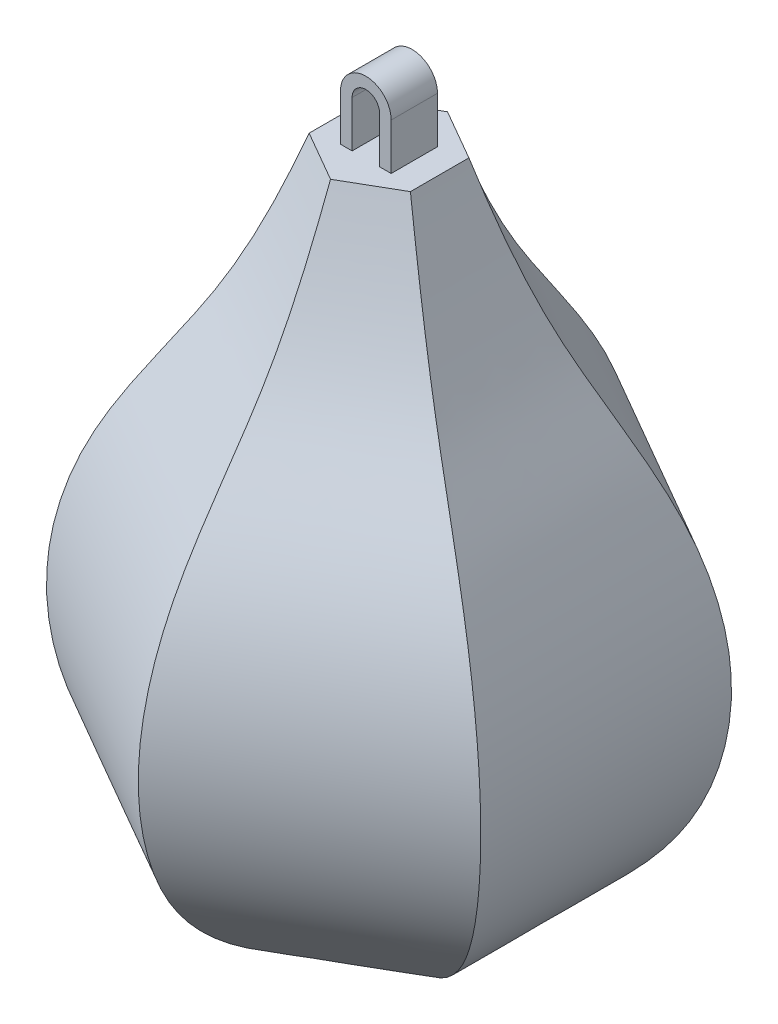
ISO-10303-21;
HEADER;
FILE_DESCRIPTION(('STEP AP214'),'2;1');
FILE_NAME('part.step','',(''),(''),'','','');
FILE_SCHEMA(('AUTOMOTIVE_DESIGN { 1 0 10303 214 1 1 1 1 }'));
ENDSEC;
DATA;
#1=APPLICATION_CONTEXT('core data for automotive mechanical design processes');
#2=APPLICATION_PROTOCOL_DEFINITION('international standard','automotive_design',2000,#1);
#3=PRODUCT_CONTEXT('',#1,'mechanical');
#4=PRODUCT('Part','Part','',(#3));
#5=PRODUCT_RELATED_PRODUCT_CATEGORY('part','',(#4));
#6=PRODUCT_DEFINITION_FORMATION('','',#4);
#7=PRODUCT_DEFINITION_CONTEXT('part definition',#1,'design');
#8=PRODUCT_DEFINITION('design','',#6,#7);
#9=PRODUCT_DEFINITION_SHAPE('','',#8);
#10=(LENGTH_UNIT() NAMED_UNIT(*) SI_UNIT(.MILLI.,.METRE.));
#11=(NAMED_UNIT(*) PLANE_ANGLE_UNIT() SI_UNIT($,.RADIAN.));
#12=(NAMED_UNIT(*) SI_UNIT($,.STERADIAN.) SOLID_ANGLE_UNIT());
#13=UNCERTAINTY_MEASURE_WITH_UNIT(LENGTH_MEASURE(1.E-05),#10,'distance_accuracy_value','');
#14=(GEOMETRIC_REPRESENTATION_CONTEXT(3) GLOBAL_UNCERTAINTY_ASSIGNED_CONTEXT((#13)) GLOBAL_UNIT_ASSIGNED_CONTEXT((#10,
#11,#12)) REPRESENTATION_CONTEXT('',''));
#15=CARTESIAN_POINT('',(0.,0.,0.));
#16=DIRECTION('',(0.,0.,1.));
#17=DIRECTION('',(1.,0.,0.));
#18=AXIS2_PLACEMENT_3D('',#15,#16,#17);
#19=CARTESIAN_POINT('',(0.,230.,0.));
#20=DIRECTION('',(0.,1.,0.));
#21=DIRECTION('',(0.,0.,1.));
#22=AXIS2_PLACEMENT_3D('',#19,#20,#21);
#23=PLANE('',#22);
#24=DIRECTION('',(0.,0.,-1.));
#25=VECTOR('',#24,1.);
#26=CARTESIAN_POINT('',(-4.75,230.,8.));
#27=LINE('',#26,#25);
#28=CARTESIAN_POINT('',(-4.75,230.,8.));
#29=VERTEX_POINT('',#28);
#30=CARTESIAN_POINT('',(-4.75,230.,-8.));
#31=VERTEX_POINT('',#30);
#32=EDGE_CURVE('E208',#29,#31,#27,.T.);
#33=ORIENTED_EDGE('',*,*,#32,.F.);
#34=DIRECTION('',(1.,0.,0.));
#35=VECTOR('',#34,1.);
#36=CARTESIAN_POINT('',(-8.75,230.,8.));
#37=LINE('',#36,#35);
#38=CARTESIAN_POINT('',(-8.75,230.,8.));
#39=VERTEX_POINT('',#38);
#40=EDGE_CURVE('E171',#39,#29,#37,.T.);
#41=ORIENTED_EDGE('',*,*,#40,.F.);
#42=DIRECTION('',(0.,0.,-1.));
#43=VECTOR('',#42,1.);
#44=CARTESIAN_POINT('',(-8.75,230.,8.));
#45=LINE('',#44,#43);
#46=CARTESIAN_POINT('',(-8.75,230.,-8.));
#47=VERTEX_POINT('',#46);
#48=EDGE_CURVE('E211',#39,#47,#45,.T.);
#49=ORIENTED_EDGE('',*,*,#48,.T.);
#50=DIRECTION('',(1.,0.,0.));
#51=VECTOR('',#50,1.);
#52=CARTESIAN_POINT('',(-8.75,230.,-8.));
#53=LINE('',#52,#51);
#54=EDGE_CURVE('E192',#47,#31,#53,.T.);
#55=ORIENTED_EDGE('',*,*,#54,.T.);
#56=EDGE_LOOP('',(#33,#41,#49,#55));
#57=FACE_BOUND('',#56,.T.);
#58=DIRECTION('',(0.866025403784439,0.,0.5));
#59=VECTOR('',#58,1.);
#60=CARTESIAN_POINT('',(-17.5,230.,10.1036297108184));
#61=LINE('',#60,#59);
#62=CARTESIAN_POINT('',(-17.5,230.,10.1036297108184));
#63=VERTEX_POINT('',#62);
#64=CARTESIAN_POINT('',(0.,230.,20.2072594216369));
#65=VERTEX_POINT('',#64);
#66=EDGE_CURVE('E215',#63,#65,#61,.T.);
#67=ORIENTED_EDGE('',*,*,#66,.T.);
#68=DIRECTION('',(0.866025403784439,0.,-0.5));
#69=VECTOR('',#68,1.);
#70=CARTESIAN_POINT('',(0.,230.,20.2072594216369));
#71=LINE('',#70,#69);
#72=CARTESIAN_POINT('',(17.5,230.,10.1036297108184));
#73=VERTEX_POINT('',#72);
#74=EDGE_CURVE('E283',#65,#73,#71,.T.);
#75=ORIENTED_EDGE('',*,*,#74,.T.);
#76=DIRECTION('',(0.,0.,-1.));
#77=VECTOR('',#76,1.);
#78=CARTESIAN_POINT('',(17.5,230.,10.1036297108184));
#79=LINE('',#78,#77);
#80=CARTESIAN_POINT('',(17.5,230.,-10.1036297108185));
#81=VERTEX_POINT('',#80);
#82=EDGE_CURVE('E492',#73,#81,#79,.T.);
#83=ORIENTED_EDGE('',*,*,#82,.T.);
#84=DIRECTION('',(-0.866025403784439,0.,-0.5));
#85=VECTOR('',#84,1.);
#86=CARTESIAN_POINT('',(17.5,230.,-10.1036297108185));
#87=LINE('',#86,#85);
#88=CARTESIAN_POINT('',(0.,230.,-20.2072594216369));
#89=VERTEX_POINT('',#88);
#90=EDGE_CURVE('E486',#81,#89,#87,.T.);
#91=ORIENTED_EDGE('',*,*,#90,.T.);
#92=DIRECTION('',(-0.866025403784439,0.,0.5));
#93=VECTOR('',#92,1.);
#94=CARTESIAN_POINT('',(0.,230.,-20.2072594216369));
#95=LINE('',#94,#93);
#96=CARTESIAN_POINT('',(-17.5,230.,-10.1036297108185));
#97=VERTEX_POINT('',#96);
#98=EDGE_CURVE('E400',#89,#97,#95,.T.);
#99=ORIENTED_EDGE('',*,*,#98,.T.);
#100=DIRECTION('',(0.,0.,1.));
#101=VECTOR('',#100,1.);
#102=CARTESIAN_POINT('',(-17.5,230.,-10.1036297108185));
#103=LINE('',#102,#101);
#104=EDGE_CURVE('E469',#97,#63,#103,.T.);
#105=ORIENTED_EDGE('',*,*,#104,.T.);
#106=EDGE_LOOP('',(#67,#75,#83,#91,#99,#105));
#107=FACE_BOUND('',#106,.T.);
#108=DIRECTION('',(0.,0.,-1.));
#109=VECTOR('',#108,1.);
#110=CARTESIAN_POINT('',(8.75000000000001,230.,8.));
#111=LINE('',#110,#109);
#112=CARTESIAN_POINT('',(8.75000000000001,230.,8.));
#113=VERTEX_POINT('',#112);
#114=CARTESIAN_POINT('',(8.75000000000001,230.,-8.));
#115=VERTEX_POINT('',#114);
#116=EDGE_CURVE('E65',#113,#115,#111,.T.);
#117=ORIENTED_EDGE('',*,*,#116,.F.);
#118=DIRECTION('',(1.,0.,0.));
#119=VECTOR('',#118,1.);
#120=CARTESIAN_POINT('',(4.75000000000001,230.,8.));
#121=LINE('',#120,#119);
#122=CARTESIAN_POINT('',(4.75000000000001,230.,8.));
#123=VERTEX_POINT('',#122);
#124=EDGE_CURVE('E69',#123,#113,#121,.T.);
#125=ORIENTED_EDGE('',*,*,#124,.F.);
#126=DIRECTION('',(0.,0.,-1.));
#127=VECTOR('',#126,1.);
#128=CARTESIAN_POINT('',(4.75000000000001,230.,8.));
#129=LINE('',#128,#127);
#130=CARTESIAN_POINT('',(4.75000000000001,230.,-8.));
#131=VERTEX_POINT('',#130);
#132=EDGE_CURVE('E183',#123,#131,#129,.T.);
#133=ORIENTED_EDGE('',*,*,#132,.T.);
#134=DIRECTION('',(1.,0.,0.));
#135=VECTOR('',#134,1.);
#136=CARTESIAN_POINT('',(4.75000000000001,230.,-8.));
#137=LINE('',#136,#135);
#138=EDGE_CURVE('E184',#131,#115,#137,.T.);
#139=ORIENTED_EDGE('',*,*,#138,.T.);
#140=EDGE_LOOP('',(#117,#125,#133,#139));
#141=FACE_BOUND('',#140,.T.);
#142=ADVANCED_FACE('F47',(#57,#107,#141),#23,.T.);
#143=CARTESIAN_POINT('',(0.,0.,0.));
#144=DIRECTION('',(0.,1.,0.));
#145=DIRECTION('',(0.,0.,1.));
#146=AXIS2_PLACEMENT_3D('',#143,#144,#145);
#147=PLANE('',#146);
#148=DIRECTION('',(0.866025403784439,0.,0.5));
#149=VECTOR('',#148,1.);
#150=CARTESIAN_POINT('',(-20.,0.,11.5470053837925));
#151=LINE('',#150,#149);
#152=CARTESIAN_POINT('',(-20.,0.,11.5470053837925));
#153=VERTEX_POINT('',#152);
#154=CARTESIAN_POINT('',(0.,0.,23.094010767585));
#155=VERTEX_POINT('',#154);
#156=EDGE_CURVE('E411',#153,#155,#151,.T.);
#157=ORIENTED_EDGE('',*,*,#156,.F.);
#158=DIRECTION('',(0.,0.,1.));
#159=VECTOR('',#158,1.);
#160=CARTESIAN_POINT('',(-20.,0.,-11.5470053837925));
#161=LINE('',#160,#159);
#162=CARTESIAN_POINT('',(-20.,0.,-11.5470053837925));
#163=VERTEX_POINT('',#162);
#164=EDGE_CURVE('E12',#163,#153,#161,.T.);
#165=ORIENTED_EDGE('',*,*,#164,.F.);
#166=DIRECTION('',(-0.866025403784439,0.,0.5));
#167=VECTOR('',#166,1.);
#168=CARTESIAN_POINT('',(0.,0.,-23.094010767585));
#169=LINE('',#168,#167);
#170=CARTESIAN_POINT('',(0.,0.,-23.094010767585));
#171=VERTEX_POINT('',#170);
#172=EDGE_CURVE('E57',#171,#163,#169,.T.);
#173=ORIENTED_EDGE('',*,*,#172,.F.);
#174=DIRECTION('',(-0.866025403784439,0.,-0.5));
#175=VECTOR('',#174,1.);
#176=CARTESIAN_POINT('',(20.,0.,-11.5470053837925));
#177=LINE('',#176,#175);
#178=CARTESIAN_POINT('',(20.,0.,-11.5470053837925));
#179=VERTEX_POINT('',#178);
#180=EDGE_CURVE('E365',#179,#171,#177,.T.);
#181=ORIENTED_EDGE('',*,*,#180,.F.);
#182=DIRECTION('',(0.,0.,-1.));
#183=VECTOR('',#182,1.);
#184=CARTESIAN_POINT('',(20.,0.,11.5470053837925));
#185=LINE('',#184,#183);
#186=CARTESIAN_POINT('',(20.,0.,11.5470053837925));
#187=VERTEX_POINT('',#186);
#188=EDGE_CURVE('E342',#187,#179,#185,.T.);
#189=ORIENTED_EDGE('',*,*,#188,.F.);
#190=DIRECTION('',(0.866025403784439,0.,-0.5));
#191=VECTOR('',#190,1.);
#192=CARTESIAN_POINT('',(0.,0.,23.094010767585));
#193=LINE('',#192,#191);
#194=EDGE_CURVE('E449',#155,#187,#193,.T.);
#195=ORIENTED_EDGE('',*,*,#194,.F.);
#196=EDGE_LOOP('',(#157,#165,#173,#181,#189,#195));
#197=FACE_BOUND('',#196,.T.);
#198=ADVANCED_FACE('F240',(#197),#147,.F.);
#199=CARTESIAN_POINT('',(-20.,0.,-11.5470053837925));
#200=CARTESIAN_POINT('',(-38.5782747603834,10.0532481363152,-22.2731773177787));
#201=CARTESIAN_POINT('',(-66.4179175298763,30.175840695107,-38.3464025648885));
#202=CARTESIAN_POINT('',(-78.6104133130519,83.4781598482992,-45.3857432873982));
#203=CARTESIAN_POINT('',(-67.2767704858389,133.971135215515,-38.8422615502078));
#204=CARTESIAN_POINT('',(-35.7912072285013,177.691718086682,-20.6640631279969));
#205=CARTESIAN_POINT('',(-23.2057441810805,212.724749092462,-13.3978426496924));
#206=CARTESIAN_POINT('',(-17.5,230.,-10.1036297108185));
#207=CARTESIAN_POINT('',(-20.,0.,-3.8490017945975));
#208=CARTESIAN_POINT('',(-38.5782747603834,10.0532481363152,-7.42439243925957));
#209=CARTESIAN_POINT('',(-66.4179175298763,30.175840695107,-12.7821341882962));
#210=CARTESIAN_POINT('',(-78.6104133130519,83.4781598482992,-15.1285810957994));
#211=CARTESIAN_POINT('',(-67.2767704858389,133.971135215515,-12.9474205167359));
#212=CARTESIAN_POINT('',(-35.7912072285013,177.691718086682,-6.88802104266564));
#213=CARTESIAN_POINT('',(-23.2057441810805,212.724749092462,-4.46594754989747));
#214=CARTESIAN_POINT('',(-17.5,230.,-3.36787657027282));
#215=CARTESIAN_POINT('',(-20.,0.,3.84900179459751));
#216=CARTESIAN_POINT('',(-38.5782747603834,10.0532481363152,7.42439243925956));
#217=CARTESIAN_POINT('',(-66.4179175298763,30.175840695107,12.7821341882961));
#218=CARTESIAN_POINT('',(-78.6104133130519,83.4781598482992,15.1285810957994));
#219=CARTESIAN_POINT('',(-67.2767704858389,133.971135215515,12.9474205167359));
#220=CARTESIAN_POINT('',(-35.7912072285013,177.691718086682,6.88802104266564));
#221=CARTESIAN_POINT('',(-23.2057441810805,212.724749092462,4.46594754989747));
#222=CARTESIAN_POINT('',(-17.5,230.,3.36787657027281));
#223=CARTESIAN_POINT('',(-20.,0.,11.5470053837925));
#224=CARTESIAN_POINT('',(-38.5782747603834,10.0532481363152,22.2731773177787));
#225=CARTESIAN_POINT('',(-66.4179175298763,30.175840695107,38.3464025648885));
#226=CARTESIAN_POINT('',(-78.6104133130519,83.4781598482992,45.3857432873982));
#227=CARTESIAN_POINT('',(-67.2767704858389,133.971135215515,38.8422615502077));
#228=CARTESIAN_POINT('',(-35.7912072285013,177.691718086682,20.6640631279969));
#229=CARTESIAN_POINT('',(-23.2057441810805,212.724749092462,13.3978426496924));
#230=CARTESIAN_POINT('',(-17.5,230.,10.1036297108184));
#231=B_SPLINE_SURFACE_WITH_KNOTS('',3,3,((#199,#200,#201,#202,#203,#204,#205,#206),(#207,#208,
#209,#210,#211,#212,#213,#214),(#215,#216,#217,#218,#219,#220,#221,#222),(#223,#224,#225,#226,
#227,#228,#229,#230)),.UNSPECIFIED.,.F.,.F.,.F.,(4,4),(4,1,1,1,1,4),(0.,1.),(0.,
0.234591966834388,0.389139212504296,0.579946693526155,0.796843671175481,1.),.UNSPECIFIED.);
#232=CARTESIAN_POINT('',(-20.,0.,11.5470053837925));
#233=CARTESIAN_POINT('',(-38.5782747603834,10.0532481363152,22.2731773177787));
#234=CARTESIAN_POINT('',(-66.4179175298763,30.175840695107,38.3464025648885));
#235=CARTESIAN_POINT('',(-78.6104133130519,83.4781598482992,45.3857432873982));
#236=CARTESIAN_POINT('',(-67.2767704858389,133.971135215515,38.8422615502077));
#237=CARTESIAN_POINT('',(-35.7912072285013,177.691718086682,20.6640631279969));
#238=CARTESIAN_POINT('',(-23.2057441810805,212.724749092462,13.3978426496924));
#239=CARTESIAN_POINT('',(-17.5,230.,10.1036297108184));
#240=B_SPLINE_CURVE_WITH_KNOTS('',3,(#232,#233,#234,#235,#236,#237,#238,#239),.UNSPECIFIED.,.F.,
.F.,(4,1,1,1,1,4),(0.,0.234591966834388,0.389139212504296,0.579946693526155,0.796843671175481,
1.),.UNSPECIFIED.);
#241=EDGE_CURVE('E517',#153,#63,#240,.T.);
#242=CARTESIAN_POINT('',(-20.,0.,-11.5470053837925));
#243=CARTESIAN_POINT('',(-38.5782747603834,10.0532481363152,-22.2731773177787));
#244=CARTESIAN_POINT('',(-66.4179175298763,30.175840695107,-38.3464025648885));
#245=CARTESIAN_POINT('',(-78.6104133130519,83.4781598482992,-45.3857432873982));
#246=CARTESIAN_POINT('',(-67.2767704858389,133.971135215515,-38.8422615502078));
#247=CARTESIAN_POINT('',(-35.7912072285013,177.691718086682,-20.6640631279969));
#248=CARTESIAN_POINT('',(-23.2057441810805,212.724749092462,-13.3978426496924));
#249=CARTESIAN_POINT('',(-17.5,230.,-10.1036297108185));
#250=B_SPLINE_CURVE_WITH_KNOTS('',3,(#242,#243,#244,#245,#246,#247,#248,#249),.UNSPECIFIED.,.F.,
.F.,(4,1,1,1,1,4),(0.,0.234591966834388,0.389139212504296,0.579946693526155,0.796843671175481,
1.),.UNSPECIFIED.);
#251=EDGE_CURVE('E225',#97,#163,#250,.F.);
#252=ORIENTED_EDGE('',*,*,#164,.T.);
#253=ORIENTED_EDGE('',*,*,#241,.T.);
#254=ORIENTED_EDGE('',*,*,#104,.F.);
#255=ORIENTED_EDGE('',*,*,#251,.T.);
#256=EDGE_LOOP('',(#252,#253,#254,#255));
#257=FACE_BOUND('',#256,.T.);
#258=ADVANCED_FACE('F227',(#257),#231,.T.);
#259=CARTESIAN_POINT('',(-20.,0.,11.5470053837925));
#260=CARTESIAN_POINT('',(-38.5782747603834,10.0532481363152,22.2731773177787));
#261=CARTESIAN_POINT('',(-66.4179175298763,30.175840695107,38.3464025648885));
#262=CARTESIAN_POINT('',(-78.6104133130519,83.4781598482992,45.3857432873982));
#263=CARTESIAN_POINT('',(-67.2767704858389,133.971135215515,38.8422615502077));
#264=CARTESIAN_POINT('',(-35.7912072285013,177.691718086682,20.6640631279969));
#265=CARTESIAN_POINT('',(-23.2057441810805,212.724749092462,13.3978426496924));
#266=CARTESIAN_POINT('',(-17.5,230.,10.1036297108184));
#267=CARTESIAN_POINT('',(-13.3333333333333,0.,15.39600717839));
#268=CARTESIAN_POINT('',(-25.7188498402556,10.0532481363152,29.6975697570383));
#269=CARTESIAN_POINT('',(-44.2786116865843,30.175840695107,51.1285367531846));
#270=CARTESIAN_POINT('',(-52.4069422087012,83.4781598482992,60.5143243831977));
#271=CARTESIAN_POINT('',(-44.8511803238926,133.971135215515,51.7896820669436));
#272=CARTESIAN_POINT('',(-23.8608048190009,177.691718086682,27.5520841706626));
#273=CARTESIAN_POINT('',(-15.4704961207203,212.724749092462,17.8637901995899));
#274=CARTESIAN_POINT('',(-11.6666666666667,230.,13.4715062810913));
#275=CARTESIAN_POINT('',(-6.66666666666666,0.,19.2450089729875));
#276=CARTESIAN_POINT('',(-12.8594249201278,10.0532481363152,37.1219621962978));
#277=CARTESIAN_POINT('',(-22.1393058432922,30.175840695107,63.9106709414808));
#278=CARTESIAN_POINT('',(-26.2034711043506,83.4781598482992,75.6429054789971));
#279=CARTESIAN_POINT('',(-22.4255901619463,133.971135215515,64.7371025836796));
#280=CARTESIAN_POINT('',(-11.9304024095004,177.691718086682,34.4401052133282));
#281=CARTESIAN_POINT('',(-7.73524806036016,212.724749092462,22.3297377494874));
#282=CARTESIAN_POINT('',(-5.83333333333333,230.,16.8393828513641));
#283=CARTESIAN_POINT('',(0.,0.,23.094010767585));
#284=CARTESIAN_POINT('',(0.,10.0532481363152,44.5463546355574));
#285=CARTESIAN_POINT('',(0.,30.175840695107,76.6928051297769));
#286=CARTESIAN_POINT('',(0.,83.4781598482992,90.7714865747965));
#287=CARTESIAN_POINT('',(0.,133.971135215515,77.6845231004155));
#288=CARTESIAN_POINT('',(0.,177.691718086682,41.3281262559938));
#289=CARTESIAN_POINT('',(0.,212.724749092462,26.7956852993848));
#290=CARTESIAN_POINT('',(0.,230.,20.2072594216369));
#291=B_SPLINE_SURFACE_WITH_KNOTS('',3,3,((#259,#260,#261,#262,#263,#264,#265,#266),(#267,#268,
#269,#270,#271,#272,#273,#274),(#275,#276,#277,#278,#279,#280,#281,#282),(#283,#284,#285,#286,
#287,#288,#289,#290)),.UNSPECIFIED.,.F.,.F.,.F.,(4,4),(4,1,1,1,1,4),(0.,1.),(0.,
0.234591966834388,0.389139212504296,0.579946693526155,0.796843671175481,1.),.UNSPECIFIED.);
#292=CARTESIAN_POINT('',(0.,0.,23.094010767585));
#293=CARTESIAN_POINT('',(0.,10.0532481363152,44.5463546355574));
#294=CARTESIAN_POINT('',(0.,30.175840695107,76.6928051297769));
#295=CARTESIAN_POINT('',(0.,83.4781598482992,90.7714865747965));
#296=CARTESIAN_POINT('',(0.,133.971135215515,77.6845231004155));
#297=CARTESIAN_POINT('',(0.,177.691718086682,41.3281262559938));
#298=CARTESIAN_POINT('',(0.,212.724749092462,26.7956852993848));
#299=CARTESIAN_POINT('',(0.,230.,20.2072594216369));
#300=B_SPLINE_CURVE_WITH_KNOTS('',3,(#292,#293,#294,#295,#296,#297,#298,#299),.UNSPECIFIED.,.F.,
.F.,(4,1,1,1,1,4),(0.,0.234591966834388,0.389139212504296,0.579946693526155,0.796843671175481,
1.),.UNSPECIFIED.);
#301=EDGE_CURVE('E328',#155,#65,#300,.T.);
#302=ORIENTED_EDGE('',*,*,#156,.T.);
#303=ORIENTED_EDGE('',*,*,#301,.T.);
#304=ORIENTED_EDGE('',*,*,#66,.F.);
#305=ORIENTED_EDGE('',*,*,#241,.F.);
#306=EDGE_LOOP('',(#302,#303,#304,#305));
#307=FACE_BOUND('',#306,.T.);
#308=ADVANCED_FACE('F239',(#307),#291,.T.);
#309=CARTESIAN_POINT('',(0.,0.,-23.094010767585));
#310=CARTESIAN_POINT('',(0.,10.0532481363152,-44.5463546355574));
#311=CARTESIAN_POINT('',(0.,30.175840695107,-76.6928051297769));
#312=CARTESIAN_POINT('',(0.,83.4781598482992,-90.7714865747965));
#313=CARTESIAN_POINT('',(0.,133.971135215515,-77.6845231004155));
#314=CARTESIAN_POINT('',(0.,177.691718086682,-41.3281262559938));
#315=CARTESIAN_POINT('',(0.,212.724749092462,-26.7956852993848));
#316=CARTESIAN_POINT('',(0.,230.,-20.2072594216369));
#317=CARTESIAN_POINT('',(-6.66666666666667,0.,-19.2450089729875));
#318=CARTESIAN_POINT('',(-12.8594249201278,10.0532481363152,-37.1219621962978));
#319=CARTESIAN_POINT('',(-22.139305843292,30.175840695107,-63.9106709414808));
#320=CARTESIAN_POINT('',(-26.2034711043507,83.4781598482992,-75.6429054789971));
#321=CARTESIAN_POINT('',(-22.4255901619463,133.971135215515,-64.7371025836796));
#322=CARTESIAN_POINT('',(-11.9304024095004,177.691718086682,-34.4401052133282));
#323=CARTESIAN_POINT('',(-7.73524806036017,212.724749092462,-22.3297377494874));
#324=CARTESIAN_POINT('',(-5.83333333333334,230.,-16.8393828513641));
#325=CARTESIAN_POINT('',(-13.3333333333333,0.,-15.39600717839));
#326=CARTESIAN_POINT('',(-25.7188498402556,10.0532481363152,-29.6975697570383));
#327=CARTESIAN_POINT('',(-44.2786116865842,30.175840695107,-51.1285367531846));
#328=CARTESIAN_POINT('',(-52.4069422087013,83.4781598482992,-60.5143243831977));
#329=CARTESIAN_POINT('',(-44.8511803238926,133.971135215515,-51.7896820669437));
#330=CARTESIAN_POINT('',(-23.8608048190009,177.691718086682,-27.5520841706625));
#331=CARTESIAN_POINT('',(-15.4704961207203,212.724749092462,-17.8637901995899));
#332=CARTESIAN_POINT('',(-11.6666666666667,230.,-13.4715062810913));
#333=CARTESIAN_POINT('',(-20.,0.,-11.5470053837925));
#334=CARTESIAN_POINT('',(-38.5782747603834,10.0532481363152,-22.2731773177787));
#335=CARTESIAN_POINT('',(-66.4179175298763,30.175840695107,-38.3464025648885));
#336=CARTESIAN_POINT('',(-78.6104133130519,83.4781598482992,-45.3857432873983));
#337=CARTESIAN_POINT('',(-67.2767704858389,133.971135215515,-38.8422615502078));
#338=CARTESIAN_POINT('',(-35.7912072285013,177.691718086682,-20.6640631279969));
#339=CARTESIAN_POINT('',(-23.2057441810805,212.724749092462,-13.3978426496924));
#340=CARTESIAN_POINT('',(-17.5,230.,-10.1036297108184));
#341=B_SPLINE_SURFACE_WITH_KNOTS('',3,3,((#309,#310,#311,#312,#313,#314,#315,#316),(#317,#318,
#319,#320,#321,#322,#323,#324),(#325,#326,#327,#328,#329,#330,#331,#332),(#333,#334,#335,#336,
#337,#338,#339,#340)),.UNSPECIFIED.,.F.,.F.,.F.,(4,4),(4,1,1,1,1,4),(0.,1.),(0.,
0.234591966834388,0.389139212504296,0.579946693526155,0.796843671175481,1.),.UNSPECIFIED.);
#342=CARTESIAN_POINT('',(0.,0.,-23.094010767585));
#343=CARTESIAN_POINT('',(0.,10.0532481363152,-44.5463546355574));
#344=CARTESIAN_POINT('',(0.,30.175840695107,-76.6928051297769));
#345=CARTESIAN_POINT('',(-1.0720669007416E-13,83.4781598482992,-90.7714865747965));
#346=CARTESIAN_POINT('',(0.,133.971135215515,-77.6845231004155));
#347=CARTESIAN_POINT('',(0.,177.691718086682,-41.3281262559938));
#348=CARTESIAN_POINT('',(0.,212.724749092462,-26.7956852993848));
#349=CARTESIAN_POINT('',(0.,230.,-20.2072594216369));
#350=B_SPLINE_CURVE_WITH_KNOTS('',3,(#342,#343,#344,#345,#346,#347,#348,#349),.UNSPECIFIED.,.F.,
.F.,(4,1,1,1,1,4),(0.,0.234591966834388,0.389139212504296,0.579946693526155,0.796843671175481,
1.),.UNSPECIFIED.);
#351=EDGE_CURVE('E353',#171,#89,#350,.T.);
#352=ORIENTED_EDGE('',*,*,#172,.T.);
#353=ORIENTED_EDGE('',*,*,#251,.F.);
#354=ORIENTED_EDGE('',*,*,#98,.F.);
#355=ORIENTED_EDGE('',*,*,#351,.F.);
#356=EDGE_LOOP('',(#352,#353,#354,#355));
#357=FACE_BOUND('',#356,.T.);
#358=ADVANCED_FACE('F301',(#357),#341,.T.);
#359=CARTESIAN_POINT('',(0.,0.,23.094010767585));
#360=CARTESIAN_POINT('',(0.,10.0532481363152,44.5463546355574));
#361=CARTESIAN_POINT('',(0.,30.175840695107,76.6928051297769));
#362=CARTESIAN_POINT('',(0.,83.4781598482992,90.7714865747965));
#363=CARTESIAN_POINT('',(0.,133.971135215515,77.6845231004155));
#364=CARTESIAN_POINT('',(0.,177.691718086682,41.3281262559938));
#365=CARTESIAN_POINT('',(0.,212.724749092462,26.7956852993848));
#366=CARTESIAN_POINT('',(0.,230.,20.2072594216369));
#367=CARTESIAN_POINT('',(6.66666666666667,0.,19.2450089729875));
#368=CARTESIAN_POINT('',(12.8594249201278,10.0532481363152,37.1219621962978));
#369=CARTESIAN_POINT('',(22.1393058432921,30.175840695107,63.9106709414808));
#370=CARTESIAN_POINT('',(26.2034711043506,83.4781598482992,75.6429054789971));
#371=CARTESIAN_POINT('',(22.4255901619463,133.971135215515,64.7371025836795));
#372=CARTESIAN_POINT('',(11.9304024095004,177.691718086682,34.4401052133282));
#373=CARTESIAN_POINT('',(7.73524806036017,212.724749092462,22.3297377494874));
#374=CARTESIAN_POINT('',(5.83333333333334,230.,16.8393828513641));
#375=CARTESIAN_POINT('',(13.3333333333333,0.,15.39600717839));
#376=CARTESIAN_POINT('',(25.7188498402556,10.0532481363152,29.6975697570382));
#377=CARTESIAN_POINT('',(44.2786116865842,30.175840695107,51.1285367531846));
#378=CARTESIAN_POINT('',(52.4069422087012,83.4781598482992,60.5143243831977));
#379=CARTESIAN_POINT('',(44.8511803238926,133.971135215515,51.7896820669436));
#380=CARTESIAN_POINT('',(23.8608048190009,177.691718086682,27.5520841706626));
#381=CARTESIAN_POINT('',(15.4704961207203,212.724749092462,17.8637901995899));
#382=CARTESIAN_POINT('',(11.6666666666667,230.,13.4715062810913));
#383=CARTESIAN_POINT('',(20.,0.,11.5470053837925));
#384=CARTESIAN_POINT('',(38.5782747603834,10.0532481363152,22.2731773177787));
#385=CARTESIAN_POINT('',(66.4179175298763,30.175840695107,38.3464025648885));
#386=CARTESIAN_POINT('',(78.6104133130518,83.4781598482992,45.3857432873982));
#387=CARTESIAN_POINT('',(67.2767704858389,133.971135215515,38.8422615502078));
#388=CARTESIAN_POINT('',(35.7912072285013,177.691718086682,20.664063127997));
#389=CARTESIAN_POINT('',(23.2057441810805,212.724749092462,13.3978426496924));
#390=CARTESIAN_POINT('',(17.5,230.,10.1036297108184));
#391=B_SPLINE_SURFACE_WITH_KNOTS('',3,3,((#359,#360,#361,#362,#363,#364,#365,#366),(#367,#368,
#369,#370,#371,#372,#373,#374),(#375,#376,#377,#378,#379,#380,#381,#382),(#383,#384,#385,#386,
#387,#388,#389,#390)),.UNSPECIFIED.,.F.,.F.,.F.,(4,4),(4,1,1,1,1,4),(0.,1.),(0.,
0.234591966834388,0.389139212504296,0.579946693526155,0.796843671175481,1.),.UNSPECIFIED.);
#392=CARTESIAN_POINT('',(20.,0.,11.5470053837925));
#393=CARTESIAN_POINT('',(38.5782747603834,10.0532481363152,22.2731773177787));
#394=CARTESIAN_POINT('',(66.4179175298763,30.175840695107,38.3464025648885));
#395=CARTESIAN_POINT('',(78.6104133130518,83.4781598482992,45.3857432873982));
#396=CARTESIAN_POINT('',(67.2767704858389,133.971135215515,38.8422615502078));
#397=CARTESIAN_POINT('',(35.7912072285013,177.691718086682,20.664063127997));
#398=CARTESIAN_POINT('',(23.2057441810805,212.724749092462,13.3978426496924));
#399=CARTESIAN_POINT('',(17.5,230.,10.1036297108184));
#400=B_SPLINE_CURVE_WITH_KNOTS('',3,(#392,#393,#394,#395,#396,#397,#398,#399),.UNSPECIFIED.,.F.,
.F.,(4,1,1,1,1,4),(0.,0.234591966834388,0.389139212504296,0.579946693526155,0.796843671175481,
1.),.UNSPECIFIED.);
#401=EDGE_CURVE('E321',#187,#73,#400,.T.);
#402=ORIENTED_EDGE('',*,*,#194,.T.);
#403=ORIENTED_EDGE('',*,*,#401,.T.);
#404=ORIENTED_EDGE('',*,*,#74,.F.);
#405=ORIENTED_EDGE('',*,*,#301,.F.);
#406=EDGE_LOOP('',(#402,#403,#404,#405));
#407=FACE_BOUND('',#406,.T.);
#408=ADVANCED_FACE('F289',(#407),#391,.T.);
#409=CARTESIAN_POINT('',(20.,0.,11.5470053837925));
#410=CARTESIAN_POINT('',(38.5782747603834,10.0532481363152,22.2731773177787));
#411=CARTESIAN_POINT('',(66.4179175298763,30.175840695107,38.3464025648885));
#412=CARTESIAN_POINT('',(78.6104133130519,83.4781598482992,45.3857432873982));
#413=CARTESIAN_POINT('',(67.2767704858389,133.971135215515,38.8422615502078));
#414=CARTESIAN_POINT('',(35.7912072285013,177.691718086682,20.664063127997));
#415=CARTESIAN_POINT('',(23.2057441810805,212.724749092462,13.3978426496924));
#416=CARTESIAN_POINT('',(17.5,230.,10.1036297108184));
#417=CARTESIAN_POINT('',(20.,0.,3.8490017945975));
#418=CARTESIAN_POINT('',(38.5782747603834,10.0532481363152,7.42439243925956));
#419=CARTESIAN_POINT('',(66.4179175298763,30.175840695107,12.7821341882961));
#420=CARTESIAN_POINT('',(78.6104133130518,83.4781598482992,15.1285810957994));
#421=CARTESIAN_POINT('',(67.2767704858389,133.971135215515,12.947420516736));
#422=CARTESIAN_POINT('',(35.7912072285013,177.691718086682,6.88802104266566));
#423=CARTESIAN_POINT('',(23.2057441810805,212.724749092462,4.46594754989748));
#424=CARTESIAN_POINT('',(17.5,230.,3.36787657027281));
#425=CARTESIAN_POINT('',(20.,0.,-3.84900179459751));
#426=CARTESIAN_POINT('',(38.5782747603834,10.0532481363152,-7.42439243925957));
#427=CARTESIAN_POINT('',(66.4179175298763,30.175840695107,-12.7821341882962));
#428=CARTESIAN_POINT('',(78.6104133130518,83.4781598482992,-15.1285810957994));
#429=CARTESIAN_POINT('',(67.2767704858389,133.971135215515,-12.9474205167359));
#430=CARTESIAN_POINT('',(35.7912072285013,177.691718086682,-6.88802104266564));
#431=CARTESIAN_POINT('',(23.2057441810805,212.724749092462,-4.46594754989748));
#432=CARTESIAN_POINT('',(17.5,230.,-3.36787657027282));
#433=CARTESIAN_POINT('',(20.,0.,-11.5470053837925));
#434=CARTESIAN_POINT('',(38.5782747603834,10.0532481363152,-22.2731773177787));
#435=CARTESIAN_POINT('',(66.4179175298763,30.175840695107,-38.3464025648885));
#436=CARTESIAN_POINT('',(78.6104133130518,83.4781598482992,-45.3857432873982));
#437=CARTESIAN_POINT('',(67.2767704858389,133.971135215515,-38.8422615502077));
#438=CARTESIAN_POINT('',(35.7912072285013,177.691718086682,-20.6640631279969));
#439=CARTESIAN_POINT('',(23.2057441810805,212.724749092462,-13.3978426496924));
#440=CARTESIAN_POINT('',(17.5,230.,-10.1036297108185));
#441=B_SPLINE_SURFACE_WITH_KNOTS('',3,3,((#409,#410,#411,#412,#413,#414,#415,#416),(#417,#418,
#419,#420,#421,#422,#423,#424),(#425,#426,#427,#428,#429,#430,#431,#432),(#433,#434,#435,#436,
#437,#438,#439,#440)),.UNSPECIFIED.,.F.,.F.,.F.,(4,4),(4,1,1,1,1,4),(0.,1.),(0.,
0.234591966834388,0.389139212504296,0.579946693526155,0.796843671175481,1.),.UNSPECIFIED.);
#442=CARTESIAN_POINT('',(20.,0.,-11.5470053837925));
#443=CARTESIAN_POINT('',(38.5782747603834,10.0532481363152,-22.2731773177787));
#444=CARTESIAN_POINT('',(66.4179175298763,30.175840695107,-38.3464025648885));
#445=CARTESIAN_POINT('',(78.6104133130518,83.4781598482992,-45.3857432873982));
#446=CARTESIAN_POINT('',(67.2767704858389,133.971135215515,-38.8422615502077));
#447=CARTESIAN_POINT('',(35.7912072285013,177.691718086682,-20.6640631279969));
#448=CARTESIAN_POINT('',(23.2057441810805,212.724749092462,-13.3978426496924));
#449=CARTESIAN_POINT('',(17.5,230.,-10.1036297108185));
#450=B_SPLINE_CURVE_WITH_KNOTS('',3,(#442,#443,#444,#445,#446,#447,#448,#449),.UNSPECIFIED.,.F.,
.F.,(4,1,1,1,1,4),(0.,0.234591966834388,0.389139212504296,0.579946693526155,0.796843671175481,
1.),.UNSPECIFIED.);
#451=EDGE_CURVE('E329',#179,#81,#450,.T.);
#452=ORIENTED_EDGE('',*,*,#188,.T.);
#453=ORIENTED_EDGE('',*,*,#451,.T.);
#454=ORIENTED_EDGE('',*,*,#82,.F.);
#455=ORIENTED_EDGE('',*,*,#401,.F.);
#456=EDGE_LOOP('',(#452,#453,#454,#455));
#457=FACE_BOUND('',#456,.T.);
#458=ADVANCED_FACE('F300',(#457),#441,.T.);
#459=CARTESIAN_POINT('',(20.,0.,-11.5470053837925));
#460=CARTESIAN_POINT('',(38.5782747603834,10.0532481363152,-22.2731773177787));
#461=CARTESIAN_POINT('',(66.4179175298763,30.175840695107,-38.3464025648885));
#462=CARTESIAN_POINT('',(78.6104133130518,83.4781598482992,-45.3857432873982));
#463=CARTESIAN_POINT('',(67.2767704858389,133.971135215515,-38.8422615502078));
#464=CARTESIAN_POINT('',(35.7912072285013,177.691718086682,-20.6640631279969));
#465=CARTESIAN_POINT('',(23.2057441810805,212.724749092462,-13.3978426496924));
#466=CARTESIAN_POINT('',(17.5,230.,-10.1036297108185));
#467=CARTESIAN_POINT('',(13.3333333333333,0.,-15.39600717839));
#468=CARTESIAN_POINT('',(25.7188498402556,10.0532481363152,-29.6975697570383));
#469=CARTESIAN_POINT('',(44.2786116865842,30.175840695107,-51.1285367531846));
#470=CARTESIAN_POINT('',(52.4069422087012,83.4781598482992,-60.5143243831976));
#471=CARTESIAN_POINT('',(44.8511803238926,133.971135215515,-51.7896820669437));
#472=CARTESIAN_POINT('',(23.8608048190009,177.691718086682,-27.5520841706625));
#473=CARTESIAN_POINT('',(15.4704961207203,212.724749092462,-17.8637901995899));
#474=CARTESIAN_POINT('',(11.6666666666667,230.,-13.4715062810913));
#475=CARTESIAN_POINT('',(6.66666666666666,0.,-19.2450089729875));
#476=CARTESIAN_POINT('',(12.8594249201278,10.0532481363152,-37.1219621962978));
#477=CARTESIAN_POINT('',(22.1393058432922,30.175840695107,-63.9106709414808));
#478=CARTESIAN_POINT('',(26.2034711043505,83.4781598482992,-75.6429054789971));
#479=CARTESIAN_POINT('',(22.4255901619463,133.971135215515,-64.7371025836796));
#480=CARTESIAN_POINT('',(11.9304024095004,177.691718086682,-34.4401052133282));
#481=CARTESIAN_POINT('',(7.73524806036017,212.724749092462,-22.3297377494874));
#482=CARTESIAN_POINT('',(5.83333333333333,230.,-16.8393828513641));
#483=CARTESIAN_POINT('',(0.,0.,-23.094010767585));
#484=CARTESIAN_POINT('',(0.,10.0532481363152,-44.5463546355574));
#485=CARTESIAN_POINT('',(0.,30.175840695107,-76.6928051297769));
#486=CARTESIAN_POINT('',(-1.0720669007416E-13,83.4781598482992,-90.7714865747965));
#487=CARTESIAN_POINT('',(0.,133.971135215515,-77.6845231004155));
#488=CARTESIAN_POINT('',(0.,177.691718086682,-41.3281262559938));
#489=CARTESIAN_POINT('',(0.,212.724749092462,-26.7956852993848));
#490=CARTESIAN_POINT('',(0.,230.,-20.2072594216369));
#491=B_SPLINE_SURFACE_WITH_KNOTS('',3,3,((#459,#460,#461,#462,#463,#464,#465,#466),(#467,#468,
#469,#470,#471,#472,#473,#474),(#475,#476,#477,#478,#479,#480,#481,#482),(#483,#484,#485,#486,
#487,#488,#489,#490)),.UNSPECIFIED.,.F.,.F.,.F.,(4,4),(4,1,1,1,1,4),(0.,1.),(0.,
0.234591966834388,0.389139212504296,0.579946693526155,0.796843671175481,1.),.UNSPECIFIED.);
#492=ORIENTED_EDGE('',*,*,#180,.T.);
#493=ORIENTED_EDGE('',*,*,#351,.T.);
#494=ORIENTED_EDGE('',*,*,#90,.F.);
#495=ORIENTED_EDGE('',*,*,#451,.F.);
#496=EDGE_LOOP('',(#492,#493,#494,#495));
#497=FACE_BOUND('',#496,.T.);
#498=ADVANCED_FACE('F371',(#497),#491,.T.);
#499=CARTESIAN_POINT('',(8.75,246.,8.));
#500=DIRECTION('',(1.,0.,0.));
#501=DIRECTION('',(0.,1.,0.));
#502=AXIS2_PLACEMENT_3D('',#499,#500,#501);
#503=PLANE('',#502);
#504=DIRECTION('',(0.,-1.,0.));
#505=VECTOR('',#504,1.);
#506=CARTESIAN_POINT('',(8.75,246.,-8.));
#507=LINE('',#506,#505);
#508=CARTESIAN_POINT('',(8.75,246.,-8.));
#509=VERTEX_POINT('',#508);
#510=EDGE_CURVE('E154',#509,#115,#507,.T.);
#511=ORIENTED_EDGE('',*,*,#510,.F.);
#512=DIRECTION('',(0.,0.,-1.));
#513=VECTOR('',#512,1.);
#514=CARTESIAN_POINT('',(8.75,246.,8.));
#515=LINE('',#514,#513);
#516=CARTESIAN_POINT('',(8.75,246.,8.));
#517=VERTEX_POINT('',#516);
#518=EDGE_CURVE('E149',#517,#509,#515,.T.);
#519=ORIENTED_EDGE('',*,*,#518,.F.);
#520=DIRECTION('',(0.,-1.,0.));
#521=VECTOR('',#520,1.);
#522=CARTESIAN_POINT('',(8.75,246.,8.));
#523=LINE('',#522,#521);
#524=EDGE_CURVE('E152',#517,#113,#523,.T.);
#525=ORIENTED_EDGE('',*,*,#524,.T.);
#526=ORIENTED_EDGE('',*,*,#116,.T.);
#527=EDGE_LOOP('',(#511,#519,#525,#526));
#528=FACE_BOUND('',#527,.T.);
#529=ADVANCED_FACE('F151',(#528),#503,.T.);
#530=CARTESIAN_POINT('',(0.,246.,8.));
#531=DIRECTION('',(0.,0.,-1.));
#532=DIRECTION('',(-1.,0.,0.));
#533=AXIS2_PLACEMENT_3D('',#530,#531,#532);
#534=CYLINDRICAL_SURFACE('',#533,8.75);
#535=CARTESIAN_POINT('',(0.,246.,-8.));
#536=DIRECTION('',(0.,0.,-1.));
#537=DIRECTION('',(-1.,0.,0.));
#538=AXIS2_PLACEMENT_3D('',#535,#536,#537);
#539=CIRCLE('',#538,8.75);
#540=CARTESIAN_POINT('',(-8.75,246.,-8.));
#541=VERTEX_POINT('',#540);
#542=EDGE_CURVE('E187',#541,#509,#539,.T.);
#543=ORIENTED_EDGE('',*,*,#542,.F.);
#544=DIRECTION('',(0.,0.,-1.));
#545=VECTOR('',#544,1.);
#546=CARTESIAN_POINT('',(-8.75,246.,8.));
#547=LINE('',#546,#545);
#548=CARTESIAN_POINT('',(-8.75,246.,8.));
#549=VERTEX_POINT('',#548);
#550=EDGE_CURVE('E159',#549,#541,#547,.T.);
#551=ORIENTED_EDGE('',*,*,#550,.F.);
#552=CARTESIAN_POINT('',(0.,246.,8.));
#553=DIRECTION('',(0.,0.,-1.));
#554=DIRECTION('',(-1.,0.,0.));
#555=AXIS2_PLACEMENT_3D('',#552,#553,#554);
#556=CIRCLE('',#555,8.75);
#557=EDGE_CURVE('E165',#549,#517,#556,.T.);
#558=ORIENTED_EDGE('',*,*,#557,.T.);
#559=ORIENTED_EDGE('',*,*,#518,.T.);
#560=EDGE_LOOP('',(#543,#551,#558,#559));
#561=FACE_BOUND('',#560,.T.);
#562=ADVANCED_FACE('F168',(#561),#534,.T.);
#563=CARTESIAN_POINT('',(-8.75,230.,8.));
#564=DIRECTION('',(-1.,0.,0.));
#565=DIRECTION('',(0.,-1.,0.));
#566=AXIS2_PLACEMENT_3D('',#563,#564,#565);
#567=PLANE('',#566);
#568=DIRECTION('',(0.,1.,0.));
#569=VECTOR('',#568,1.);
#570=CARTESIAN_POINT('',(-8.75,230.,-8.));
#571=LINE('',#570,#569);
#572=EDGE_CURVE('E189',#47,#541,#571,.T.);
#573=ORIENTED_EDGE('',*,*,#572,.F.);
#574=ORIENTED_EDGE('',*,*,#48,.F.);
#575=DIRECTION('',(0.,1.,0.));
#576=VECTOR('',#575,1.);
#577=CARTESIAN_POINT('',(-8.75,230.,8.));
#578=LINE('',#577,#576);
#579=EDGE_CURVE('E169',#39,#549,#578,.T.);
#580=ORIENTED_EDGE('',*,*,#579,.T.);
#581=ORIENTED_EDGE('',*,*,#550,.T.);
#582=EDGE_LOOP('',(#573,#574,#580,#581));
#583=FACE_BOUND('',#582,.T.);
#584=ADVANCED_FACE('F590',(#583),#567,.T.);
#585=CARTESIAN_POINT('',(-4.75,230.,8.));
#586=DIRECTION('',(-1.,0.,0.));
#587=DIRECTION('',(0.,-1.,0.));
#588=AXIS2_PLACEMENT_3D('',#585,#586,#587);
#589=PLANE('',#588);
#590=DIRECTION('',(0.,1.,0.));
#591=VECTOR('',#590,1.);
#592=CARTESIAN_POINT('',(-4.75,230.,-8.));
#593=LINE('',#592,#591);
#594=CARTESIAN_POINT('',(-4.75,246.,-8.));
#595=VERTEX_POINT('',#594);
#596=EDGE_CURVE('E194',#31,#595,#593,.T.);
#597=ORIENTED_EDGE('',*,*,#596,.T.);
#598=DIRECTION('',(0.,0.,-1.));
#599=VECTOR('',#598,1.);
#600=CARTESIAN_POINT('',(-4.75,246.,8.));
#601=LINE('',#600,#599);
#602=CARTESIAN_POINT('',(-4.75,246.,8.));
#603=VERTEX_POINT('',#602);
#604=EDGE_CURVE('E205',#603,#595,#601,.T.);
#605=ORIENTED_EDGE('',*,*,#604,.F.);
#606=DIRECTION('',(0.,1.,0.));
#607=VECTOR('',#606,1.);
#608=CARTESIAN_POINT('',(-4.75,230.,8.));
#609=LINE('',#608,#607);
#610=EDGE_CURVE('E177',#29,#603,#609,.T.);
#611=ORIENTED_EDGE('',*,*,#610,.F.);
#612=ORIENTED_EDGE('',*,*,#32,.T.);
#613=EDGE_LOOP('',(#597,#605,#611,#612));
#614=FACE_BOUND('',#613,.T.);
#615=ADVANCED_FACE('F574',(#614),#589,.F.);
#616=CARTESIAN_POINT('',(0.,246.,8.));
#617=DIRECTION('',(0.,0.,-1.));
#618=DIRECTION('',(-1.,0.,0.));
#619=AXIS2_PLACEMENT_3D('',#616,#617,#618);
#620=CYLINDRICAL_SURFACE('',#619,4.75);
#621=CARTESIAN_POINT('',(0.,246.,-8.));
#622=DIRECTION('',(0.,0.,-1.));
#623=DIRECTION('',(-1.,0.,0.));
#624=AXIS2_PLACEMENT_3D('',#621,#622,#623);
#625=CIRCLE('',#624,4.75);
#626=CARTESIAN_POINT('',(4.75000000000001,246.,-8.));
#627=VERTEX_POINT('',#626);
#628=EDGE_CURVE('E196',#595,#627,#625,.T.);
#629=ORIENTED_EDGE('',*,*,#628,.T.);
#630=DIRECTION('',(0.,0.,-1.));
#631=VECTOR('',#630,1.);
#632=CARTESIAN_POINT('',(4.75000000000001,246.,8.));
#633=LINE('',#632,#631);
#634=CARTESIAN_POINT('',(4.75000000000001,246.,8.));
#635=VERTEX_POINT('',#634);
#636=EDGE_CURVE('E202',#635,#627,#633,.T.);
#637=ORIENTED_EDGE('',*,*,#636,.F.);
#638=CARTESIAN_POINT('',(0.,246.,8.));
#639=DIRECTION('',(0.,0.,-1.));
#640=DIRECTION('',(-1.,0.,0.));
#641=AXIS2_PLACEMENT_3D('',#638,#639,#640);
#642=CIRCLE('',#641,4.75);
#643=EDGE_CURVE('E179',#603,#635,#642,.T.);
#644=ORIENTED_EDGE('',*,*,#643,.F.);
#645=ORIENTED_EDGE('',*,*,#604,.T.);
#646=EDGE_LOOP('',(#629,#637,#644,#645));
#647=FACE_BOUND('',#646,.T.);
#648=ADVANCED_FACE('F579',(#647),#620,.F.);
#649=CARTESIAN_POINT('',(4.75,246.,8.));
#650=DIRECTION('',(1.,0.,0.));
#651=DIRECTION('',(0.,1.,0.));
#652=AXIS2_PLACEMENT_3D('',#649,#650,#651);
#653=PLANE('',#652);
#654=DIRECTION('',(0.,-1.,0.));
#655=VECTOR('',#654,1.);
#656=CARTESIAN_POINT('',(4.75,246.,-8.));
#657=LINE('',#656,#655);
#658=EDGE_CURVE('E198',#627,#131,#657,.T.);
#659=ORIENTED_EDGE('',*,*,#658,.T.);
#660=ORIENTED_EDGE('',*,*,#132,.F.);
#661=DIRECTION('',(0.,-1.,0.));
#662=VECTOR('',#661,1.);
#663=CARTESIAN_POINT('',(4.75,246.,8.));
#664=LINE('',#663,#662);
#665=EDGE_CURVE('E181',#635,#123,#664,.T.);
#666=ORIENTED_EDGE('',*,*,#665,.F.);
#667=ORIENTED_EDGE('',*,*,#636,.T.);
#668=EDGE_LOOP('',(#659,#660,#666,#667));
#669=FACE_BOUND('',#668,.T.);
#670=ADVANCED_FACE('F583',(#669),#653,.F.);
#671=CARTESIAN_POINT('',(0.,246.,8.));
#672=DIRECTION('',(0.,0.,-1.));
#673=DIRECTION('',(-1.,0.,0.));
#674=AXIS2_PLACEMENT_3D('',#671,#672,#673);
#675=PLANE('',#674);
#676=ORIENTED_EDGE('',*,*,#124,.T.);
#677=ORIENTED_EDGE('',*,*,#524,.F.);
#678=ORIENTED_EDGE('',*,*,#557,.F.);
#679=ORIENTED_EDGE('',*,*,#579,.F.);
#680=ORIENTED_EDGE('',*,*,#40,.T.);
#681=ORIENTED_EDGE('',*,*,#610,.T.);
#682=ORIENTED_EDGE('',*,*,#643,.T.);
#683=ORIENTED_EDGE('',*,*,#665,.T.);
#684=EDGE_LOOP('',(#676,#677,#678,#679,#680,#681,#682,#683));
#685=FACE_BOUND('',#684,.T.);
#686=ADVANCED_FACE('F163',(#685),#675,.F.);
#687=CARTESIAN_POINT('',(0.,246.,-8.));
#688=DIRECTION('',(0.,0.,-1.));
#689=DIRECTION('',(-1.,0.,0.));
#690=AXIS2_PLACEMENT_3D('',#687,#688,#689);
#691=PLANE('',#690);
#692=ORIENTED_EDGE('',*,*,#138,.F.);
#693=ORIENTED_EDGE('',*,*,#658,.F.);
#694=ORIENTED_EDGE('',*,*,#628,.F.);
#695=ORIENTED_EDGE('',*,*,#596,.F.);
#696=ORIENTED_EDGE('',*,*,#54,.F.);
#697=ORIENTED_EDGE('',*,*,#572,.T.);
#698=ORIENTED_EDGE('',*,*,#542,.T.);
#699=ORIENTED_EDGE('',*,*,#510,.T.);
#700=EDGE_LOOP('',(#692,#693,#694,#695,#696,#697,#698,#699));
#701=FACE_BOUND('',#700,.T.);
#702=ADVANCED_FACE('F587',(#701),#691,.T.);
#703=CLOSED_SHELL('',(#142,#198,#258,#308,#358,#408,#458,#498,#529,#562,#584,#615,#648,#670,
#686,#702));
#704=MANIFOLD_SOLID_BREP('B2',#703);
#705=ADVANCED_BREP_SHAPE_REPRESENTATION('',(#18,#704),#14);
#706=SHAPE_DEFINITION_REPRESENTATION(#9,#705);
ENDSEC;
END-ISO-10303-21;
